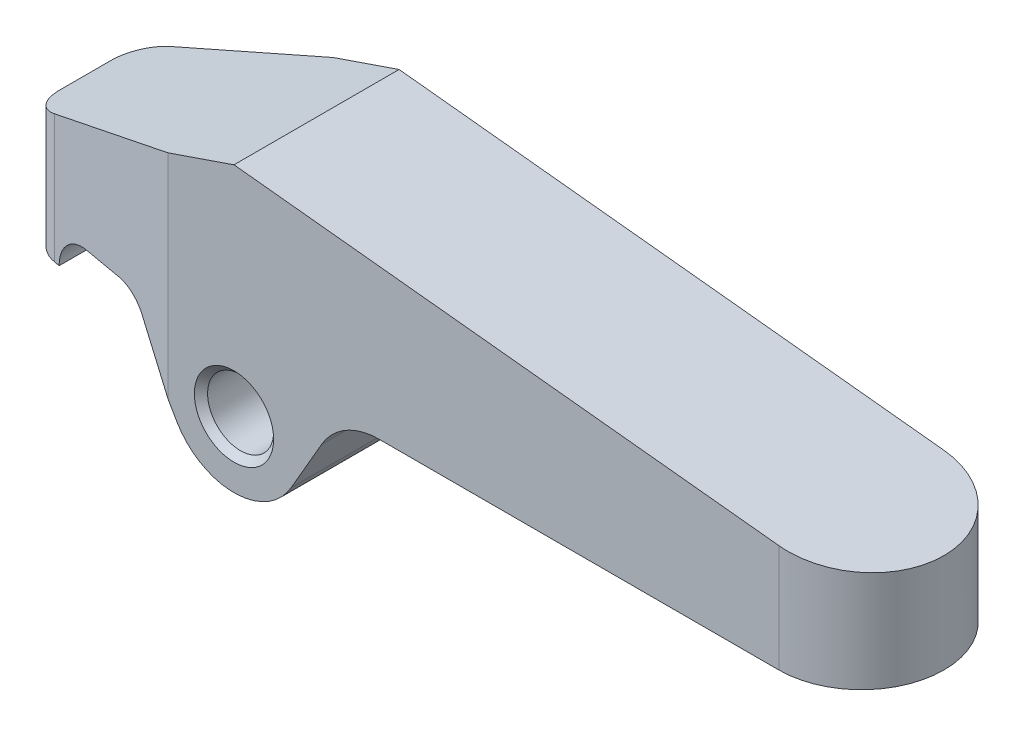
ISO-10303-21;
HEADER;
FILE_DESCRIPTION(('STEP AP214'),'2;1');
FILE_NAME('part.step','',(''),(''),'','','');
FILE_SCHEMA(('AUTOMOTIVE_DESIGN { 1 0 10303 214 1 1 1 1 }'));
ENDSEC;
DATA;
#1=APPLICATION_CONTEXT('core data for automotive mechanical design processes');
#2=APPLICATION_PROTOCOL_DEFINITION('international standard','automotive_design',2000,#1);
#3=PRODUCT_CONTEXT('',#1,'mechanical');
#4=PRODUCT('Part','Part','',(#3));
#5=PRODUCT_RELATED_PRODUCT_CATEGORY('part','',(#4));
#6=PRODUCT_DEFINITION_FORMATION('','',#4);
#7=PRODUCT_DEFINITION_CONTEXT('part definition',#1,'design');
#8=PRODUCT_DEFINITION('design','',#6,#7);
#9=PRODUCT_DEFINITION_SHAPE('','',#8);
#10=(LENGTH_UNIT() NAMED_UNIT(*) SI_UNIT(.MILLI.,.METRE.));
#11=(NAMED_UNIT(*) PLANE_ANGLE_UNIT() SI_UNIT($,.RADIAN.));
#12=(NAMED_UNIT(*) SI_UNIT($,.STERADIAN.) SOLID_ANGLE_UNIT());
#13=UNCERTAINTY_MEASURE_WITH_UNIT(LENGTH_MEASURE(1.E-05),#10,'distance_accuracy_value','');
#14=(GEOMETRIC_REPRESENTATION_CONTEXT(3) GLOBAL_UNCERTAINTY_ASSIGNED_CONTEXT((#13)) GLOBAL_UNIT_ASSIGNED_CONTEXT((#10,
#11,#12)) REPRESENTATION_CONTEXT('',''));
#15=CARTESIAN_POINT('',(0.,0.,0.));
#16=DIRECTION('',(0.,0.,1.));
#17=DIRECTION('',(1.,0.,0.));
#18=AXIS2_PLACEMENT_3D('',#15,#16,#17);
#19=CARTESIAN_POINT('',(82.5,8.,0.));
#20=DIRECTION('',(0.,1.,0.));
#21=DIRECTION('',(0.,0.,1.));
#22=AXIS2_PLACEMENT_3D('',#19,#20,#21);
#23=CYLINDRICAL_SURFACE('',#22,12.5);
#24=DIRECTION('',(0.,-1.,0.));
#25=VECTOR('',#24,1.);
#26=CARTESIAN_POINT('',(82.5,8.,12.5));
#27=LINE('',#26,#25);
#28=CARTESIAN_POINT('',(82.5,8.,12.5));
#29=VERTEX_POINT('',#28);
#30=CARTESIAN_POINT('',(82.5,24.3157894736842,12.5));
#31=VERTEX_POINT('',#30);
#32=EDGE_CURVE('E242',#29,#31,#27,.F.);
#33=ORIENTED_EDGE('',*,*,#32,.F.);
#34=CARTESIAN_POINT('',(82.5,8.,0.));
#35=DIRECTION('',(0.,1.,0.));
#36=DIRECTION('',(-1.,0.,0.));
#37=AXIS2_PLACEMENT_3D('',#34,#35,#36);
#38=CIRCLE('',#37,12.5);
#39=CARTESIAN_POINT('',(82.5,8.,-12.5));
#40=VERTEX_POINT('',#39);
#41=EDGE_CURVE('E42',#40,#29,#38,.F.);
#42=ORIENTED_EDGE('',*,*,#41,.F.);
#43=DIRECTION('',(0.,1.,0.));
#44=VECTOR('',#43,1.);
#45=CARTESIAN_POINT('',(82.5,0.,-12.5));
#46=LINE('',#45,#44);
#47=CARTESIAN_POINT('',(82.5,24.3157894736842,-12.5));
#48=VERTEX_POINT('',#47);
#49=EDGE_CURVE('E245',#48,#40,#46,.F.);
#50=ORIENTED_EDGE('',*,*,#49,.F.);
#51=CARTESIAN_POINT('',(82.5,24.3157894736842,0.));
#52=DIRECTION('',(-0.104684784518043,-0.994505452921406,0.));
#53=DIRECTION('',(-0.994505452921406,0.104684784518043,0.));
#54=AXIS2_PLACEMENT_3D('',#51,#52,#53);
#55=ELLIPSE('',#54,12.5690612990413,12.5);
#56=EDGE_CURVE('E11',#31,#48,#55,.F.);
#57=ORIENTED_EDGE('',*,*,#56,.F.);
#58=EDGE_LOOP('',(#33,#42,#50,#57));
#59=FACE_BOUND('',#58,.T.);
#60=ADVANCED_FACE('F34',(#59),#23,.T.);
#61=CARTESIAN_POINT('',(0.,0.,12.5));
#62=DIRECTION('',(0.,0.,1.));
#63=DIRECTION('',(1.,0.,0.));
#64=AXIS2_PLACEMENT_3D('',#61,#62,#63);
#65=PLANE('',#64);
#66=CARTESIAN_POINT('',(0.,0.,12.5));
#67=DIRECTION('',(0.,0.,1.));
#68=DIRECTION('',(1.,0.,0.));
#69=AXIS2_PLACEMENT_3D('',#66,#67,#68);
#70=CIRCLE('',#69,6.00000000000001);
#71=CARTESIAN_POINT('',(6.00000000000001,0.,12.5));
#72=VERTEX_POINT('',#71);
#73=EDGE_CURVE('E221',#72,#72,#70,.F.);
#74=ORIENTED_EDGE('',*,*,#73,.T.);
#75=EDGE_LOOP('',(#74));
#76=FACE_BOUND('',#75,.T.);
#77=DIRECTION('',(1.,0.,0.));
#78=VECTOR('',#77,1.);
#79=CARTESIAN_POINT('',(21.9393102292058,8.,12.5));
#80=LINE('',#79,#78);
#81=CARTESIAN_POINT('',(21.9393102292058,8.,12.5));
#82=VERTEX_POINT('',#81);
#83=EDGE_CURVE('E251',#82,#29,#80,.T.);
#84=ORIENTED_EDGE('',*,*,#83,.T.);
#85=ORIENTED_EDGE('',*,*,#32,.T.);
#86=DIRECTION('',(-0.994505452921406,0.104684784518043,0.));
#87=VECTOR('',#86,1.);
#88=CARTESIAN_POINT('',(95.,23.,12.5));
#89=LINE('',#88,#87);
#90=CARTESIAN_POINT('',(0.,33.,12.5));
#91=VERTEX_POINT('',#90);
#92=EDGE_CURVE('E255',#31,#91,#89,.T.);
#93=ORIENTED_EDGE('',*,*,#92,.T.);
#94=DIRECTION('',(-0.945945945945946,-0.324324324324324,0.));
#95=VECTOR('',#94,1.);
#96=CARTESIAN_POINT('',(0.,33.,12.5));
#97=LINE('',#96,#95);
#98=CARTESIAN_POINT('',(-9.99999999999951,29.5714285714288,12.5));
#99=VERTEX_POINT('',#98);
#100=EDGE_CURVE('E257',#91,#99,#97,.T.);
#101=ORIENTED_EDGE('',*,*,#100,.T.);
#102=DIRECTION('',(0.,-1.,0.));
#103=VECTOR('',#102,1.);
#104=CARTESIAN_POINT('',(-9.99999999999951,3.00000000000003,12.5));
#105=LINE('',#104,#103);
#106=CARTESIAN_POINT('',(-9.99999999999951,-2.6794919243121,12.5));
#107=VERTEX_POINT('',#106);
#108=EDGE_CURVE('E177',#99,#107,#105,.T.);
#109=ORIENTED_EDGE('',*,*,#108,.T.);
#110=DIRECTION('',(0.500000000000004,-0.866025403784436,0.));
#111=VECTOR('',#110,1.);
#112=CARTESIAN_POINT('',(-8.66025403784436,-5.00000000000004,12.5));
#113=LINE('',#112,#111);
#114=CARTESIAN_POINT('',(-8.66025403784436,-5.00000000000004,12.5));
#115=VERTEX_POINT('',#114);
#116=EDGE_CURVE('E168',#107,#115,#113,.T.);
#117=ORIENTED_EDGE('',*,*,#116,.T.);
#118=CARTESIAN_POINT('',(0.,0.,12.5));
#119=DIRECTION('',(0.,0.,1.));
#120=DIRECTION('',(1.,0.,0.));
#121=AXIS2_PLACEMENT_3D('',#118,#119,#120);
#122=CIRCLE('',#121,10.);
#123=CARTESIAN_POINT('',(8.6602540378444,-4.99999999999998,12.5));
#124=VERTEX_POINT('',#123);
#125=EDGE_CURVE('E161',#115,#124,#122,.T.);
#126=ORIENTED_EDGE('',*,*,#125,.T.);
#127=DIRECTION('',(0.499999999999997,0.86602540378444,0.));
#128=VECTOR('',#127,1.);
#129=CARTESIAN_POINT('',(8.6602540378444,-4.99999999999998,12.5));
#130=LINE('',#129,#128);
#131=CARTESIAN_POINT('',(13.2790561913614,2.99999999999998,12.5));
#132=VERTEX_POINT('',#131);
#133=EDGE_CURVE('E150',#124,#132,#130,.T.);
#134=ORIENTED_EDGE('',*,*,#133,.T.);
#135=CARTESIAN_POINT('',(21.9393102292058,-2.,12.5));
#136=DIRECTION('',(0.,0.,-1.));
#137=DIRECTION('',(-1.,0.,0.));
#138=AXIS2_PLACEMENT_3D('',#135,#136,#137);
#139=CIRCLE('',#138,10.);
#140=EDGE_CURVE('E160',#132,#82,#139,.T.);
#141=ORIENTED_EDGE('',*,*,#140,.T.);
#142=EDGE_LOOP('',(#84,#85,#93,#101,#109,#117,#126,#134,#141));
#143=FACE_BOUND('',#142,.T.);
#144=ADVANCED_FACE('F165',(#76,#143),#65,.T.);
#145=CARTESIAN_POINT('',(0.,0.,-12.5));
#146=DIRECTION('',(0.,0.,1.));
#147=DIRECTION('',(1.,0.,0.));
#148=AXIS2_PLACEMENT_3D('',#145,#146,#147);
#149=PLANE('',#148);
#150=CARTESIAN_POINT('',(0.,0.,-12.5));
#151=DIRECTION('',(0.,0.,1.));
#152=DIRECTION('',(1.,0.,0.));
#153=AXIS2_PLACEMENT_3D('',#150,#151,#152);
#154=CIRCLE('',#153,5.99999999999999);
#155=CARTESIAN_POINT('',(5.99999999999999,0.,-12.5));
#156=VERTEX_POINT('',#155);
#157=EDGE_CURVE('E212',#156,#156,#154,.T.);
#158=ORIENTED_EDGE('',*,*,#157,.T.);
#159=EDGE_LOOP('',(#158));
#160=FACE_BOUND('',#159,.T.);
#161=DIRECTION('',(-0.994505452921406,0.104684784518043,0.));
#162=VECTOR('',#161,1.);
#163=CARTESIAN_POINT('',(95.,23.,-12.5));
#164=LINE('',#163,#162);
#165=CARTESIAN_POINT('',(0.,33.,-12.5));
#166=VERTEX_POINT('',#165);
#167=EDGE_CURVE('E271',#48,#166,#164,.T.);
#168=ORIENTED_EDGE('',*,*,#167,.F.);
#169=ORIENTED_EDGE('',*,*,#49,.T.);
#170=DIRECTION('',(1.,0.,0.));
#171=VECTOR('',#170,1.);
#172=CARTESIAN_POINT('',(21.9393102292058,8.,-12.5));
#173=LINE('',#172,#171);
#174=CARTESIAN_POINT('',(21.9393102292058,8.,-12.5));
#175=VERTEX_POINT('',#174);
#176=EDGE_CURVE('E253',#175,#40,#173,.T.);
#177=ORIENTED_EDGE('',*,*,#176,.F.);
#178=CARTESIAN_POINT('',(21.9393102292058,-2.,-12.5));
#179=DIRECTION('',(0.,0.,-1.));
#180=DIRECTION('',(-1.,0.,0.));
#181=AXIS2_PLACEMENT_3D('',#178,#179,#180);
#182=CIRCLE('',#181,10.);
#183=CARTESIAN_POINT('',(13.2790561913614,2.99999999999998,-12.5));
#184=VERTEX_POINT('',#183);
#185=EDGE_CURVE('E268',#184,#175,#182,.T.);
#186=ORIENTED_EDGE('',*,*,#185,.F.);
#187=DIRECTION('',(0.499999999999997,0.86602540378444,0.));
#188=VECTOR('',#187,1.);
#189=CARTESIAN_POINT('',(8.6602540378444,-4.99999999999998,-12.5));
#190=LINE('',#189,#188);
#191=CARTESIAN_POINT('',(8.6602540378444,-4.99999999999998,-12.5));
#192=VERTEX_POINT('',#191);
#193=EDGE_CURVE('E266',#192,#184,#190,.T.);
#194=ORIENTED_EDGE('',*,*,#193,.F.);
#195=CARTESIAN_POINT('',(0.,0.,-12.5));
#196=DIRECTION('',(0.,0.,1.));
#197=DIRECTION('',(1.,0.,0.));
#198=AXIS2_PLACEMENT_3D('',#195,#196,#197);
#199=CIRCLE('',#198,10.);
#200=CARTESIAN_POINT('',(-8.66025403784436,-5.00000000000004,-12.5));
#201=VERTEX_POINT('',#200);
#202=EDGE_CURVE('E176',#201,#192,#199,.T.);
#203=ORIENTED_EDGE('',*,*,#202,.F.);
#204=DIRECTION('',(0.500000000000004,-0.866025403784436,0.));
#205=VECTOR('',#204,1.);
#206=CARTESIAN_POINT('',(-8.66025403784436,-5.00000000000004,-12.5));
#207=LINE('',#206,#205);
#208=CARTESIAN_POINT('',(-9.99999999999951,-2.6794919243121,-12.5));
#209=VERTEX_POINT('',#208);
#210=EDGE_CURVE('E172',#209,#201,#207,.T.);
#211=ORIENTED_EDGE('',*,*,#210,.F.);
#212=DIRECTION('',(0.,1.,0.));
#213=VECTOR('',#212,1.);
#214=CARTESIAN_POINT('',(-9.99999999999951,0.,-12.5));
#215=LINE('',#214,#213);
#216=CARTESIAN_POINT('',(-9.99999999999951,29.5714285714288,-12.5));
#217=VERTEX_POINT('',#216);
#218=EDGE_CURVE('E207',#209,#217,#215,.T.);
#219=ORIENTED_EDGE('',*,*,#218,.T.);
#220=DIRECTION('',(-0.945945945945946,-0.324324324324324,0.));
#221=VECTOR('',#220,1.);
#222=CARTESIAN_POINT('',(0.,33.,-12.5));
#223=LINE('',#222,#221);
#224=EDGE_CURVE('E273',#166,#217,#223,.T.);
#225=ORIENTED_EDGE('',*,*,#224,.F.);
#226=EDGE_LOOP('',(#168,#169,#177,#186,#194,#203,#211,#219,#225));
#227=FACE_BOUND('',#226,.T.);
#228=ADVANCED_FACE('F302',(#160,#227),#149,.F.);
#229=CARTESIAN_POINT('',(0.,0.,12.5));
#230=DIRECTION('',(0.,0.,-1.));
#231=DIRECTION('',(-1.,0.,0.));
#232=AXIS2_PLACEMENT_3D('',#229,#230,#231);
#233=CYLINDRICAL_SURFACE('',#232,10.);
#234=ORIENTED_EDGE('',*,*,#202,.T.);
#235=DIRECTION('',(0.,0.,-1.));
#236=VECTOR('',#235,1.);
#237=CARTESIAN_POINT('',(8.6602540378444,-4.99999999999998,12.5));
#238=LINE('',#237,#236);
#239=EDGE_CURVE('E154',#124,#192,#238,.T.);
#240=ORIENTED_EDGE('',*,*,#239,.F.);
#241=ORIENTED_EDGE('',*,*,#125,.F.);
#242=DIRECTION('',(0.,0.,-1.));
#243=VECTOR('',#242,1.);
#244=CARTESIAN_POINT('',(-8.66025403784436,-5.00000000000004,12.5));
#245=LINE('',#244,#243);
#246=EDGE_CURVE('E264',#115,#201,#245,.T.);
#247=ORIENTED_EDGE('',*,*,#246,.T.);
#248=EDGE_LOOP('',(#234,#240,#241,#247));
#249=FACE_BOUND('',#248,.T.);
#250=ADVANCED_FACE('F174',(#249),#233,.T.);
#251=CARTESIAN_POINT('',(8.6602540378444,-4.99999999999998,12.5));
#252=DIRECTION('',(-0.86602540378444,0.499999999999997,0.));
#253=DIRECTION('',(-0.499999999999997,-0.86602540378444,0.));
#254=AXIS2_PLACEMENT_3D('',#251,#252,#253);
#255=PLANE('',#254);
#256=ORIENTED_EDGE('',*,*,#193,.T.);
#257=DIRECTION('',(0.,0.,-1.));
#258=VECTOR('',#257,1.);
#259=CARTESIAN_POINT('',(13.2790561913614,2.99999999999998,12.5));
#260=LINE('',#259,#258);
#261=EDGE_CURVE('E157',#132,#184,#260,.T.);
#262=ORIENTED_EDGE('',*,*,#261,.F.);
#263=ORIENTED_EDGE('',*,*,#133,.F.);
#264=ORIENTED_EDGE('',*,*,#239,.T.);
#265=EDGE_LOOP('',(#256,#262,#263,#264));
#266=FACE_BOUND('',#265,.T.);
#267=ADVANCED_FACE('F152',(#266),#255,.F.);
#268=CARTESIAN_POINT('',(21.9393102292058,-2.,12.5));
#269=DIRECTION('',(0.,0.,-1.));
#270=DIRECTION('',(-1.,0.,0.));
#271=AXIS2_PLACEMENT_3D('',#268,#269,#270);
#272=CYLINDRICAL_SURFACE('',#271,10.);
#273=ORIENTED_EDGE('',*,*,#185,.T.);
#274=DIRECTION('',(0.,0.,-1.));
#275=VECTOR('',#274,1.);
#276=CARTESIAN_POINT('',(21.9393102292058,8.,12.5));
#277=LINE('',#276,#275);
#278=EDGE_CURVE('E181',#82,#175,#277,.T.);
#279=ORIENTED_EDGE('',*,*,#278,.F.);
#280=ORIENTED_EDGE('',*,*,#140,.F.);
#281=ORIENTED_EDGE('',*,*,#261,.T.);
#282=EDGE_LOOP('',(#273,#279,#280,#281));
#283=FACE_BOUND('',#282,.T.);
#284=ADVANCED_FACE('F332',(#283),#272,.F.);
#285=CARTESIAN_POINT('',(21.9393102292058,8.,12.5));
#286=DIRECTION('',(0.,1.,0.));
#287=DIRECTION('',(-1.,0.,0.));
#288=AXIS2_PLACEMENT_3D('',#285,#286,#287);
#289=PLANE('',#288);
#290=ORIENTED_EDGE('',*,*,#176,.T.);
#291=ORIENTED_EDGE('',*,*,#41,.T.);
#292=ORIENTED_EDGE('',*,*,#83,.F.);
#293=ORIENTED_EDGE('',*,*,#278,.T.);
#294=EDGE_LOOP('',(#290,#291,#292,#293));
#295=FACE_BOUND('',#294,.T.);
#296=ADVANCED_FACE('F249',(#295),#289,.F.);
#297=CARTESIAN_POINT('',(95.,23.,12.5));
#298=DIRECTION('',(-0.104684784518043,-0.994505452921406,0.));
#299=DIRECTION('',(0.994505452921406,-0.104684784518043,0.));
#300=AXIS2_PLACEMENT_3D('',#297,#298,#299);
#301=PLANE('',#300);
#302=ORIENTED_EDGE('',*,*,#92,.F.);
#303=ORIENTED_EDGE('',*,*,#56,.T.);
#304=ORIENTED_EDGE('',*,*,#167,.T.);
#305=DIRECTION('',(0.,0.,-1.));
#306=VECTOR('',#305,1.);
#307=CARTESIAN_POINT('',(0.,33.,12.5));
#308=LINE('',#307,#306);
#309=EDGE_CURVE('E296',#91,#166,#308,.T.);
#310=ORIENTED_EDGE('',*,*,#309,.F.);
#311=EDGE_LOOP('',(#302,#303,#304,#310));
#312=FACE_BOUND('',#311,.T.);
#313=ADVANCED_FACE('F305',(#312),#301,.F.);
#314=CARTESIAN_POINT('',(0.,33.,12.5));
#315=DIRECTION('',(0.324324324324324,-0.945945945945946,0.));
#316=DIRECTION('',(0.945945945945946,0.324324324324324,0.));
#317=AXIS2_PLACEMENT_3D('',#314,#315,#316);
#318=PLANE('',#317);
#319=DIRECTION('',(0.933055788423863,0.319904841745324,-0.164522910005333));
#320=VECTOR('',#319,1.);
#321=CARTESIAN_POINT('',(-35.,21.,-8.09182548228837));
#322=LINE('',#321,#320);
#323=CARTESIAN_POINT('',(-30.8682408883346,22.4166031239996,-8.820366091463));
#324=VERTEX_POINT('',#323);
#325=EDGE_CURVE('E209',#217,#324,#322,.F.);
#326=ORIENTED_EDGE('',*,*,#325,.T.);
#327=CARTESIAN_POINT('',(-30.,22.7142857142857,-3.89632732640196));
#328=DIRECTION('',(0.324324324324324,-0.945945945945946,0.));
#329=DIRECTION('',(-0.945945945945946,-0.324324324324324,0.));
#330=AXIS2_PLACEMENT_3D('',#327,#328,#329);
#331=ELLIPSE('',#330,5.28571428571428,5.);
#332=CARTESIAN_POINT('',(-35.,21.,-3.89632732640196));
#333=VERTEX_POINT('',#332);
#334=EDGE_CURVE('E238',#324,#333,#331,.F.);
#335=ORIENTED_EDGE('',*,*,#334,.T.);
#336=DIRECTION('',(0.,0.,-1.));
#337=VECTOR('',#336,1.);
#338=CARTESIAN_POINT('',(-35.,21.,12.5));
#339=LINE('',#338,#337);
#340=CARTESIAN_POINT('',(-35.,21.,3.89632732640196));
#341=VERTEX_POINT('',#340);
#342=EDGE_CURVE('E293',#341,#333,#339,.T.);
#343=ORIENTED_EDGE('',*,*,#342,.F.);
#344=CARTESIAN_POINT('',(-30.,22.7142857142857,3.89632732640196));
#345=DIRECTION('',(0.324324324324324,-0.945945945945946,0.));
#346=DIRECTION('',(-0.945945945945946,-0.324324324324324,0.));
#347=AXIS2_PLACEMENT_3D('',#344,#345,#346);
#348=ELLIPSE('',#347,5.28571428571428,5.);
#349=CARTESIAN_POINT('',(-30.8682408883346,22.4166031239996,8.820366091463));
#350=VERTEX_POINT('',#349);
#351=EDGE_CURVE('E236',#341,#350,#348,.F.);
#352=ORIENTED_EDGE('',*,*,#351,.T.);
#353=DIRECTION('',(0.933055788423863,0.319904841745324,0.164522910005333));
#354=VECTOR('',#353,1.);
#355=CARTESIAN_POINT('',(-18.8267480453433,26.5451149558823,10.9436061676902));
#356=LINE('',#355,#354);
#357=EDGE_CURVE('E195',#350,#99,#356,.T.);
#358=ORIENTED_EDGE('',*,*,#357,.T.);
#359=ORIENTED_EDGE('',*,*,#100,.F.);
#360=ORIENTED_EDGE('',*,*,#309,.T.);
#361=ORIENTED_EDGE('',*,*,#224,.T.);
#362=EDGE_LOOP('',(#326,#335,#343,#352,#358,#359,#360,#361));
#363=FACE_BOUND('',#362,.T.);
#364=ADVANCED_FACE('F308',(#363),#318,.F.);
#365=CARTESIAN_POINT('',(-35.,21.,12.5));
#366=DIRECTION('',(1.,0.,0.));
#367=DIRECTION('',(0.,0.,-1.));
#368=AXIS2_PLACEMENT_3D('',#365,#366,#367);
#369=PLANE('',#368);
#370=ORIENTED_EDGE('',*,*,#342,.T.);
#371=DIRECTION('',(0.,1.,0.));
#372=VECTOR('',#371,1.);
#373=CARTESIAN_POINT('',(-35.,3.00000000000003,-3.89632732640196));
#374=LINE('',#373,#372);
#375=CARTESIAN_POINT('',(-35.,3.00000000000003,-3.89632732640196));
#376=VERTEX_POINT('',#375);
#377=EDGE_CURVE('E227',#333,#376,#374,.F.);
#378=ORIENTED_EDGE('',*,*,#377,.T.);
#379=DIRECTION('',(0.,0.,-1.));
#380=VECTOR('',#379,1.);
#381=CARTESIAN_POINT('',(-35.,3.00000000000003,12.5));
#382=LINE('',#381,#380);
#383=CARTESIAN_POINT('',(-35.,3.00000000000003,3.89632732640196));
#384=VERTEX_POINT('',#383);
#385=EDGE_CURVE('E290',#384,#376,#382,.T.);
#386=ORIENTED_EDGE('',*,*,#385,.F.);
#387=DIRECTION('',(0.,1.,0.));
#388=VECTOR('',#387,1.);
#389=CARTESIAN_POINT('',(-35.,21.,3.89632732640196));
#390=LINE('',#389,#388);
#391=EDGE_CURVE('E224',#384,#341,#390,.T.);
#392=ORIENTED_EDGE('',*,*,#391,.T.);
#393=EDGE_LOOP('',(#370,#378,#386,#392));
#394=FACE_BOUND('',#393,.T.);
#395=ADVANCED_FACE('F370',(#394),#369,.F.);
#396=CARTESIAN_POINT('',(-35.,3.00000000000003,12.5));
#397=DIRECTION('',(0.,1.,0.));
#398=DIRECTION('',(0.,0.,1.));
#399=AXIS2_PLACEMENT_3D('',#396,#397,#398);
#400=PLANE('',#399);
#401=ORIENTED_EDGE('',*,*,#385,.T.);
#402=CARTESIAN_POINT('',(-30.,3.00000000000003,-3.89632732640196));
#403=DIRECTION('',(0.,1.,0.));
#404=DIRECTION('',(0.,0.,1.));
#405=AXIS2_PLACEMENT_3D('',#402,#403,#404);
#406=CIRCLE('',#405,5.);
#407=CARTESIAN_POINT('',(-30.8682408883346,3.00000000000003,-8.820366091463));
#408=VERTEX_POINT('',#407);
#409=EDGE_CURVE('E232',#376,#408,#406,.F.);
#410=ORIENTED_EDGE('',*,*,#409,.T.);
#411=DIRECTION('',(-0.984807753012209,0.,0.173648177666927));
#412=VECTOR('',#411,1.);
#413=CARTESIAN_POINT('',(-35.,3.00000000000003,-8.09182548228837));
#414=LINE('',#413,#412);
#415=CARTESIAN_POINT('',(-30.,3.00000000000003,-8.97346038583068));
#416=VERTEX_POINT('',#415);
#417=EDGE_CURVE('E197',#408,#416,#414,.F.);
#418=ORIENTED_EDGE('',*,*,#417,.T.);
#419=DIRECTION('',(0.,0.,-1.));
#420=VECTOR('',#419,1.);
#421=CARTESIAN_POINT('',(-30.,3.00000000000003,12.5));
#422=LINE('',#421,#420);
#423=CARTESIAN_POINT('',(-30.,3.00000000000003,8.97346038583068));
#424=VERTEX_POINT('',#423);
#425=EDGE_CURVE('E287',#424,#416,#422,.T.);
#426=ORIENTED_EDGE('',*,*,#425,.F.);
#427=DIRECTION('',(-0.984807753012209,0.,-0.173648177666927));
#428=VECTOR('',#427,1.);
#429=CARTESIAN_POINT('',(-9.99999999999951,3.00000000000003,12.5));
#430=LINE('',#429,#428);
#431=CARTESIAN_POINT('',(-30.8682408883346,3.00000000000003,8.820366091463));
#432=VERTEX_POINT('',#431);
#433=EDGE_CURVE('E192',#424,#432,#430,.T.);
#434=ORIENTED_EDGE('',*,*,#433,.T.);
#435=CARTESIAN_POINT('',(-30.,3.00000000000003,3.89632732640196));
#436=DIRECTION('',(0.,1.,0.));
#437=DIRECTION('',(0.,0.,1.));
#438=AXIS2_PLACEMENT_3D('',#435,#436,#437);
#439=CIRCLE('',#438,5.);
#440=EDGE_CURVE('E230',#432,#384,#439,.F.);
#441=ORIENTED_EDGE('',*,*,#440,.T.);
#442=EDGE_LOOP('',(#401,#410,#418,#426,#434,#441));
#443=FACE_BOUND('',#442,.T.);
#444=ADVANCED_FACE('F366',(#443),#400,.F.);
#445=CARTESIAN_POINT('',(-25.,3.,12.5));
#446=DIRECTION('',(0.,0.,-1.));
#447=DIRECTION('',(-1.,0.,0.));
#448=AXIS2_PLACEMENT_3D('',#445,#446,#447);
#449=CYLINDRICAL_SURFACE('',#448,5.);
#450=ORIENTED_EDGE('',*,*,#425,.T.);
#451=CARTESIAN_POINT('',(-25.,3.,-9.85509528937299));
#452=DIRECTION('',(0.173648177666927,0.,0.984807753012209));
#453=DIRECTION('',(0.984807753012209,0.,-0.173648177666927));
#454=AXIS2_PLACEMENT_3D('',#451,#452,#453);
#455=ELLIPSE('',#454,5.07713305942872,5.);
#456=CARTESIAN_POINT('',(-25.,8.,-9.85509528937299));
#457=VERTEX_POINT('',#456);
#458=EDGE_CURVE('E199',#416,#457,#455,.F.);
#459=ORIENTED_EDGE('',*,*,#458,.T.);
#460=DIRECTION('',(0.,0.,-1.));
#461=VECTOR('',#460,1.);
#462=CARTESIAN_POINT('',(-25.,8.,12.5));
#463=LINE('',#462,#461);
#464=CARTESIAN_POINT('',(-25.,8.,9.85509528937299));
#465=VERTEX_POINT('',#464);
#466=EDGE_CURVE('E284',#465,#457,#463,.T.);
#467=ORIENTED_EDGE('',*,*,#466,.F.);
#468=CARTESIAN_POINT('',(-25.,3.,9.85509528937299));
#469=DIRECTION('',(-0.173648177666927,0.,0.984807753012209));
#470=DIRECTION('',(-0.984807753012209,0.,-0.173648177666927));
#471=AXIS2_PLACEMENT_3D('',#468,#469,#470);
#472=ELLIPSE('',#471,5.07713305942872,5.);
#473=EDGE_CURVE('E190',#465,#424,#472,.T.);
#474=ORIENTED_EDGE('',*,*,#473,.T.);
#475=EDGE_LOOP('',(#450,#459,#467,#474));
#476=FACE_BOUND('',#475,.T.);
#477=ADVANCED_FACE('F362',(#476),#449,.F.);
#478=CARTESIAN_POINT('',(-25.,8.,12.5));
#479=DIRECTION('',(0.,1.,0.));
#480=DIRECTION('',(-1.,0.,0.));
#481=AXIS2_PLACEMENT_3D('',#478,#479,#480);
#482=PLANE('',#481);
#483=ORIENTED_EDGE('',*,*,#466,.T.);
#484=DIRECTION('',(-0.984807753012209,0.,0.173648177666927));
#485=VECTOR('',#484,1.);
#486=CARTESIAN_POINT('',(-35.,8.,-8.09182548228837));
#487=LINE('',#486,#485);
#488=CARTESIAN_POINT('',(-19.0525588832577,8.,-10.9037896244295));
#489=VERTEX_POINT('',#488);
#490=EDGE_CURVE('E201',#457,#489,#487,.F.);
#491=ORIENTED_EDGE('',*,*,#490,.T.);
#492=DIRECTION('',(0.,0.,-1.));
#493=VECTOR('',#492,1.);
#494=CARTESIAN_POINT('',(-19.0525588832577,8.,12.5));
#495=LINE('',#494,#493);
#496=CARTESIAN_POINT('',(-19.0525588832577,8.,10.9037896244295));
#497=VERTEX_POINT('',#496);
#498=EDGE_CURVE('E281',#497,#489,#495,.T.);
#499=ORIENTED_EDGE('',*,*,#498,.F.);
#500=DIRECTION('',(-0.984807753012209,0.,-0.173648177666927));
#501=VECTOR('',#500,1.);
#502=CARTESIAN_POINT('',(-9.99999999999951,8.00000000000001,12.5));
#503=LINE('',#502,#501);
#504=EDGE_CURVE('E188',#497,#465,#503,.T.);
#505=ORIENTED_EDGE('',*,*,#504,.T.);
#506=EDGE_LOOP('',(#483,#491,#499,#505));
#507=FACE_BOUND('',#506,.T.);
#508=ADVANCED_FACE('F359',(#507),#482,.F.);
#509=CARTESIAN_POINT('',(-19.0525588832577,3.,12.5));
#510=DIRECTION('',(0.,0.,-1.));
#511=DIRECTION('',(-1.,0.,0.));
#512=AXIS2_PLACEMENT_3D('',#509,#510,#511);
#513=CYLINDRICAL_SURFACE('',#512,5.);
#514=ORIENTED_EDGE('',*,*,#498,.T.);
#515=CARTESIAN_POINT('',(-19.0525588832577,3.,-10.9037896244295));
#516=DIRECTION('',(0.173648177666927,0.,0.984807753012209));
#517=DIRECTION('',(0.984807753012209,0.,-0.173648177666927));
#518=AXIS2_PLACEMENT_3D('',#515,#516,#517);
#519=ELLIPSE('',#518,5.07713305942872,5.);
#520=CARTESIAN_POINT('',(-14.7224318643355,5.50000000000002,-11.6673078477602));
#521=VERTEX_POINT('',#520);
#522=EDGE_CURVE('E203',#489,#521,#519,.F.);
#523=ORIENTED_EDGE('',*,*,#522,.T.);
#524=DIRECTION('',(0.,0.,-1.));
#525=VECTOR('',#524,1.);
#526=CARTESIAN_POINT('',(-14.7224318643355,5.50000000000002,12.5));
#527=LINE('',#526,#525);
#528=CARTESIAN_POINT('',(-14.7224318643355,5.50000000000002,11.6673078477602));
#529=VERTEX_POINT('',#528);
#530=EDGE_CURVE('E278',#529,#521,#527,.T.);
#531=ORIENTED_EDGE('',*,*,#530,.F.);
#532=CARTESIAN_POINT('',(-19.0525588832577,3.,10.9037896244295));
#533=DIRECTION('',(-0.173648177666927,0.,0.984807753012209));
#534=DIRECTION('',(-0.984807753012209,0.,-0.173648177666927));
#535=AXIS2_PLACEMENT_3D('',#532,#533,#534);
#536=ELLIPSE('',#535,5.07713305942872,5.);
#537=EDGE_CURVE('E186',#529,#497,#536,.T.);
#538=ORIENTED_EDGE('',*,*,#537,.T.);
#539=EDGE_LOOP('',(#514,#523,#531,#538));
#540=FACE_BOUND('',#539,.T.);
#541=ADVANCED_FACE('F322',(#540),#513,.F.);
#542=CARTESIAN_POINT('',(-8.66025403784436,-5.00000000000004,12.5));
#543=DIRECTION('',(0.866025403784436,0.500000000000004,0.));
#544=DIRECTION('',(-0.500000000000004,0.866025403784436,0.));
#545=AXIS2_PLACEMENT_3D('',#542,#543,#544);
#546=PLANE('',#545);
#547=ORIENTED_EDGE('',*,*,#530,.T.);
#548=DIRECTION('',(-0.498068054943676,0.862679176789445,0.0878228363155546));
#549=VECTOR('',#548,1.);
#550=CARTESIAN_POINT('',(-26.5690528522671,26.0189494491091,-9.57842893736073));
#551=LINE('',#550,#549);
#552=EDGE_CURVE('E205',#521,#209,#551,.F.);
#553=ORIENTED_EDGE('',*,*,#552,.T.);
#554=ORIENTED_EDGE('',*,*,#210,.T.);
#555=ORIENTED_EDGE('',*,*,#246,.F.);
#556=ORIENTED_EDGE('',*,*,#116,.F.);
#557=DIRECTION('',(-0.498068054943676,0.862679176789445,-0.0878228363155546));
#558=VECTOR('',#557,1.);
#559=CARTESIAN_POINT('',(-11.1513051718173,-0.685372871706942,12.2969938351793));
#560=LINE('',#559,#558);
#561=EDGE_CURVE('E179',#107,#529,#560,.T.);
#562=ORIENTED_EDGE('',*,*,#561,.T.);
#563=EDGE_LOOP('',(#547,#553,#554,#555,#556,#562));
#564=FACE_BOUND('',#563,.T.);
#565=ADVANCED_FACE('F319',(#564),#546,.F.);
#566=CARTESIAN_POINT('',(0.,0.,12.5));
#567=DIRECTION('',(0.,0.,-1.));
#568=DIRECTION('',(-1.,0.,0.));
#569=AXIS2_PLACEMENT_3D('',#566,#567,#568);
#570=CYLINDRICAL_SURFACE('',#569,5.);
#571=CARTESIAN_POINT('',(0.,0.,-11.5));
#572=DIRECTION('',(0.,0.,1.));
#573=DIRECTION('',(1.,0.,0.));
#574=AXIS2_PLACEMENT_3D('',#571,#572,#573);
#575=CIRCLE('',#574,5.);
#576=CARTESIAN_POINT('',(5.,0.,-11.5));
#577=VERTEX_POINT('',#576);
#578=EDGE_CURVE('E218',#577,#577,#575,.F.);
#579=ORIENTED_EDGE('',*,*,#578,.T.);
#580=EDGE_LOOP('',(#579));
#581=FACE_BOUND('',#580,.T.);
#582=CARTESIAN_POINT('',(0.,0.,11.5));
#583=DIRECTION('',(0.,0.,1.));
#584=DIRECTION('',(1.,0.,0.));
#585=AXIS2_PLACEMENT_3D('',#582,#583,#584);
#586=CIRCLE('',#585,5.);
#587=CARTESIAN_POINT('',(5.,0.,11.5));
#588=VERTEX_POINT('',#587);
#589=EDGE_CURVE('E215',#588,#588,#586,.T.);
#590=ORIENTED_EDGE('',*,*,#589,.T.);
#591=EDGE_LOOP('',(#590));
#592=FACE_BOUND('',#591,.T.);
#593=ADVANCED_FACE('F353',(#581,#592),#570,.F.);
#594=CARTESIAN_POINT('',(-9.99999999999951,0.,12.5));
#595=DIRECTION('',(-0.173648177666927,0.,0.984807753012209));
#596=DIRECTION('',(0.,1.,0.));
#597=AXIS2_PLACEMENT_3D('',#594,#595,#596);
#598=PLANE('',#597);
#599=ORIENTED_EDGE('',*,*,#357,.F.);
#600=DIRECTION('',(0.,1.,0.));
#601=VECTOR('',#600,1.);
#602=CARTESIAN_POINT('',(-30.8682408883346,3.00000000000003,8.820366091463));
#603=LINE('',#602,#601);
#604=EDGE_CURVE('E240',#350,#432,#603,.F.);
#605=ORIENTED_EDGE('',*,*,#604,.T.);
#606=ORIENTED_EDGE('',*,*,#433,.F.);
#607=ORIENTED_EDGE('',*,*,#473,.F.);
#608=ORIENTED_EDGE('',*,*,#504,.F.);
#609=ORIENTED_EDGE('',*,*,#537,.F.);
#610=ORIENTED_EDGE('',*,*,#561,.F.);
#611=ORIENTED_EDGE('',*,*,#108,.F.);
#612=EDGE_LOOP('',(#599,#605,#606,#607,#608,#609,#610,#611));
#613=FACE_BOUND('',#612,.T.);
#614=ADVANCED_FACE('F313',(#613),#598,.T.);
#615=CARTESIAN_POINT('',(-35.,21.,-8.09182548228837));
#616=DIRECTION('',(0.173648177666927,0.,0.984807753012209));
#617=DIRECTION('',(0.,-1.,0.));
#618=AXIS2_PLACEMENT_3D('',#615,#616,#617);
#619=PLANE('',#618);
#620=ORIENTED_EDGE('',*,*,#417,.F.);
#621=DIRECTION('',(0.,-1.,0.));
#622=VECTOR('',#621,1.);
#623=CARTESIAN_POINT('',(-30.8682408883346,21.,-8.820366091463));
#624=LINE('',#623,#622);
#625=EDGE_CURVE('E234',#408,#324,#624,.F.);
#626=ORIENTED_EDGE('',*,*,#625,.T.);
#627=ORIENTED_EDGE('',*,*,#325,.F.);
#628=ORIENTED_EDGE('',*,*,#218,.F.);
#629=ORIENTED_EDGE('',*,*,#552,.F.);
#630=ORIENTED_EDGE('',*,*,#522,.F.);
#631=ORIENTED_EDGE('',*,*,#490,.F.);
#632=ORIENTED_EDGE('',*,*,#458,.F.);
#633=EDGE_LOOP('',(#620,#626,#627,#628,#629,#630,#631,#632));
#634=FACE_BOUND('',#633,.T.);
#635=ADVANCED_FACE('F328',(#634),#619,.F.);
#636=CARTESIAN_POINT('',(0.,0.,-12.5));
#637=DIRECTION('',(0.,0.,-1.));
#638=DIRECTION('',(-1.,0.,0.));
#639=AXIS2_PLACEMENT_3D('',#636,#637,#638);
#640=CONICAL_SURFACE('',#639,5.99999999999999,0.78539816339745);
#641=ORIENTED_EDGE('',*,*,#578,.F.);
#642=EDGE_LOOP('',(#641));
#643=FACE_BOUND('',#642,.T.);
#644=ORIENTED_EDGE('',*,*,#157,.F.);
#645=EDGE_LOOP('',(#644));
#646=FACE_BOUND('',#645,.T.);
#647=ADVANCED_FACE('F430',(#643,#646),#640,.F.);
#648=CARTESIAN_POINT('',(0.,0.,11.5));
#649=DIRECTION('',(0.,0.,1.));
#650=DIRECTION('',(1.,0.,0.));
#651=AXIS2_PLACEMENT_3D('',#648,#649,#650);
#652=CONICAL_SURFACE('',#651,5.,0.785398163397454);
#653=ORIENTED_EDGE('',*,*,#73,.F.);
#654=EDGE_LOOP('',(#653));
#655=FACE_BOUND('',#654,.T.);
#656=ORIENTED_EDGE('',*,*,#589,.F.);
#657=EDGE_LOOP('',(#656));
#658=FACE_BOUND('',#657,.T.);
#659=ADVANCED_FACE('F437',(#655,#658),#652,.F.);
#660=CARTESIAN_POINT('',(-30.,21.,-3.89632732640196));
#661=DIRECTION('',(0.,-1.,0.));
#662=DIRECTION('',(0.,0.,-1.));
#663=AXIS2_PLACEMENT_3D('',#660,#661,#662);
#664=CYLINDRICAL_SURFACE('',#663,5.);
#665=ORIENTED_EDGE('',*,*,#334,.F.);
#666=ORIENTED_EDGE('',*,*,#625,.F.);
#667=ORIENTED_EDGE('',*,*,#409,.F.);
#668=ORIENTED_EDGE('',*,*,#377,.F.);
#669=EDGE_LOOP('',(#665,#666,#667,#668));
#670=FACE_BOUND('',#669,.T.);
#671=ADVANCED_FACE('F444',(#670),#664,.T.);
#672=CARTESIAN_POINT('',(-30.,21.,3.89632732640196));
#673=DIRECTION('',(0.,-1.,0.));
#674=DIRECTION('',(0.,0.,-1.));
#675=AXIS2_PLACEMENT_3D('',#672,#673,#674);
#676=CYLINDRICAL_SURFACE('',#675,5.);
#677=ORIENTED_EDGE('',*,*,#440,.F.);
#678=ORIENTED_EDGE('',*,*,#604,.F.);
#679=ORIENTED_EDGE('',*,*,#351,.F.);
#680=ORIENTED_EDGE('',*,*,#391,.F.);
#681=EDGE_LOOP('',(#677,#678,#679,#680));
#682=FACE_BOUND('',#681,.T.);
#683=ADVANCED_FACE('F451',(#682),#676,.T.);
#684=CLOSED_SHELL('',(#60,#144,#228,#250,#267,#284,#296,#313,#364,#395,#444,#477,#508,#541,#565,
#593,#614,#635,#647,#659,#671,#683));
#685=MANIFOLD_SOLID_BREP('B2',#684);
#686=ADVANCED_BREP_SHAPE_REPRESENTATION('',(#18,#685),#14);
#687=SHAPE_DEFINITION_REPRESENTATION(#9,#686);
ENDSEC;
END-ISO-10303-21;
